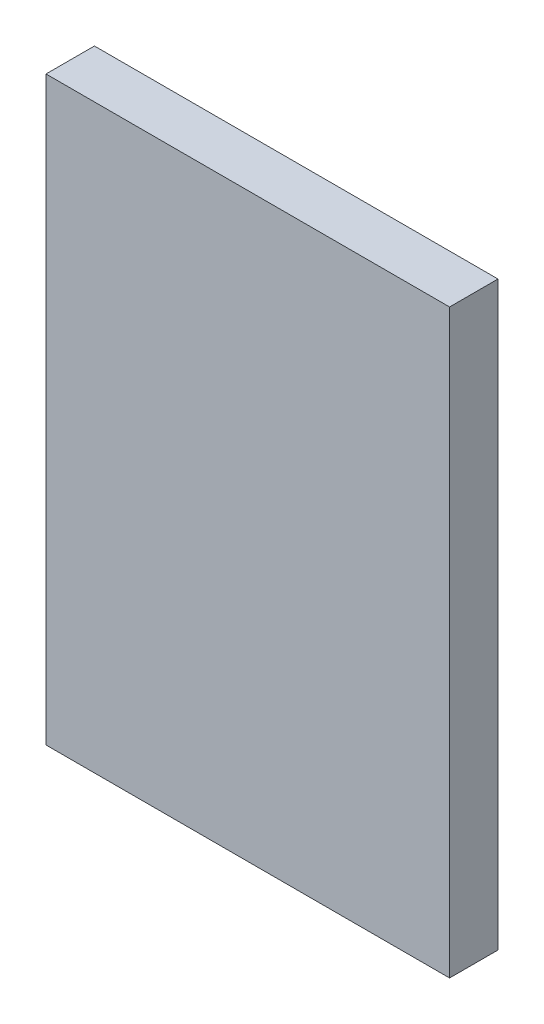
ISO-10303-21;
HEADER;
FILE_DESCRIPTION(('STEP AP214'),'2;1');
FILE_NAME('part.step','',(''),(''),'','','');
FILE_SCHEMA(('AUTOMOTIVE_DESIGN { 1 0 10303 214 1 1 1 1 }'));
ENDSEC;
DATA;
#1=APPLICATION_CONTEXT('core data for automotive mechanical design processes');
#2=APPLICATION_PROTOCOL_DEFINITION('international standard','automotive_design',2000,#1);
#3=PRODUCT_CONTEXT('',#1,'mechanical');
#4=PRODUCT('Part','Part','',(#3));
#5=PRODUCT_RELATED_PRODUCT_CATEGORY('part','',(#4));
#6=PRODUCT_DEFINITION_FORMATION('','',#4);
#7=PRODUCT_DEFINITION_CONTEXT('part definition',#1,'design');
#8=PRODUCT_DEFINITION('design','',#6,#7);
#9=PRODUCT_DEFINITION_SHAPE('','',#8);
#10=(LENGTH_UNIT() NAMED_UNIT(*) SI_UNIT(.MILLI.,.METRE.));
#11=(NAMED_UNIT(*) PLANE_ANGLE_UNIT() SI_UNIT($,.RADIAN.));
#12=(NAMED_UNIT(*) SI_UNIT($,.STERADIAN.) SOLID_ANGLE_UNIT());
#13=UNCERTAINTY_MEASURE_WITH_UNIT(LENGTH_MEASURE(1.E-05),#10,'distance_accuracy_value','');
#14=(GEOMETRIC_REPRESENTATION_CONTEXT(3) GLOBAL_UNCERTAINTY_ASSIGNED_CONTEXT((#13)) GLOBAL_UNIT_ASSIGNED_CONTEXT((#10,
#11,#12)) REPRESENTATION_CONTEXT('',''));
#15=CARTESIAN_POINT('',(0.,0.,0.));
#16=DIRECTION('',(0.,0.,1.));
#17=DIRECTION('',(1.,0.,0.));
#18=AXIS2_PLACEMENT_3D('',#15,#16,#17);
#19=CARTESIAN_POINT('',(-6.35162601626016,7.52032520325202,3.));
#20=DIRECTION('',(1.,0.,0.));
#21=DIRECTION('',(0.,1.,0.));
#22=AXIS2_PLACEMENT_3D('',#19,#20,#21);
#23=PLANE('',#22);
#24=DIRECTION('',(0.,-1.,0.));
#25=VECTOR('',#24,1.);
#26=CARTESIAN_POINT('',(-6.35162601626016,7.52032520325202,0.));
#27=LINE('',#26,#25);
#28=CARTESIAN_POINT('',(-6.35162601626016,7.52032520325202,0.));
#29=VERTEX_POINT('',#28);
#30=CARTESIAN_POINT('',(-6.35162601626016,-28.479674796748,0.));
#31=VERTEX_POINT('',#30);
#32=EDGE_CURVE('E107',#29,#31,#27,.T.);
#33=ORIENTED_EDGE('',*,*,#32,.T.);
#34=DIRECTION('',(0.,0.,-1.));
#35=VECTOR('',#34,1.);
#36=CARTESIAN_POINT('',(-6.35162601626016,-28.479674796748,3.));
#37=LINE('',#36,#35);
#38=CARTESIAN_POINT('',(-6.35162601626016,-28.479674796748,3.));
#39=VERTEX_POINT('',#38);
#40=EDGE_CURVE('E11',#39,#31,#37,.T.);
#41=ORIENTED_EDGE('',*,*,#40,.F.);
#42=DIRECTION('',(0.,-1.,0.));
#43=VECTOR('',#42,1.);
#44=CARTESIAN_POINT('',(-6.35162601626016,7.52032520325202,3.));
#45=LINE('',#44,#43);
#46=CARTESIAN_POINT('',(-6.35162601626016,7.52032520325202,3.));
#47=VERTEX_POINT('',#46);
#48=EDGE_CURVE('E91',#47,#39,#45,.T.);
#49=ORIENTED_EDGE('',*,*,#48,.F.);
#50=DIRECTION('',(0.,0.,-1.));
#51=VECTOR('',#50,1.);
#52=CARTESIAN_POINT('',(-6.35162601626016,7.52032520325202,3.));
#53=LINE('',#52,#51);
#54=EDGE_CURVE('E103',#47,#29,#53,.T.);
#55=ORIENTED_EDGE('',*,*,#54,.T.);
#56=EDGE_LOOP('',(#33,#41,#49,#55));
#57=FACE_BOUND('',#56,.T.);
#58=ADVANCED_FACE('F39',(#57),#23,.F.);
#59=CARTESIAN_POINT('',(-6.35162601626016,-28.479674796748,3.));
#60=DIRECTION('',(0.,1.,0.));
#61=DIRECTION('',(0.,0.,1.));
#62=AXIS2_PLACEMENT_3D('',#59,#60,#61);
#63=PLANE('',#62);
#64=DIRECTION('',(1.,0.,0.));
#65=VECTOR('',#64,1.);
#66=CARTESIAN_POINT('',(-6.35162601626016,-28.479674796748,0.));
#67=LINE('',#66,#65);
#68=CARTESIAN_POINT('',(18.6483739837398,-28.479674796748,0.));
#69=VERTEX_POINT('',#68);
#70=EDGE_CURVE('E96',#31,#69,#67,.T.);
#71=ORIENTED_EDGE('',*,*,#70,.T.);
#72=DIRECTION('',(0.,0.,-1.));
#73=VECTOR('',#72,1.);
#74=CARTESIAN_POINT('',(18.6483739837398,-28.479674796748,3.));
#75=LINE('',#74,#73);
#76=CARTESIAN_POINT('',(18.6483739837398,-28.479674796748,3.));
#77=VERTEX_POINT('',#76);
#78=EDGE_CURVE('E48',#77,#69,#75,.T.);
#79=ORIENTED_EDGE('',*,*,#78,.F.);
#80=DIRECTION('',(1.,0.,0.));
#81=VECTOR('',#80,1.);
#82=CARTESIAN_POINT('',(-6.35162601626016,-28.479674796748,3.));
#83=LINE('',#82,#81);
#84=EDGE_CURVE('E86',#39,#77,#83,.T.);
#85=ORIENTED_EDGE('',*,*,#84,.F.);
#86=ORIENTED_EDGE('',*,*,#40,.T.);
#87=EDGE_LOOP('',(#71,#79,#85,#86));
#88=FACE_BOUND('',#87,.T.);
#89=ADVANCED_FACE('F95',(#88),#63,.F.);
#90=CARTESIAN_POINT('',(18.6483739837398,7.52032520325202,3.));
#91=DIRECTION('',(-1.,0.,0.));
#92=DIRECTION('',(0.,-1.,0.));
#93=AXIS2_PLACEMENT_3D('',#90,#91,#92);
#94=PLANE('',#93);
#95=DIRECTION('',(0.,1.,0.));
#96=VECTOR('',#95,1.);
#97=CARTESIAN_POINT('',(18.6483739837398,7.52032520325202,0.));
#98=LINE('',#97,#96);
#99=CARTESIAN_POINT('',(18.6483739837398,7.52032520325202,0.));
#100=VERTEX_POINT('',#99);
#101=EDGE_CURVE('E73',#69,#100,#98,.T.);
#102=ORIENTED_EDGE('',*,*,#101,.T.);
#103=DIRECTION('',(0.,0.,-1.));
#104=VECTOR('',#103,1.);
#105=CARTESIAN_POINT('',(18.6483739837398,7.52032520325202,3.));
#106=LINE('',#105,#104);
#107=CARTESIAN_POINT('',(18.6483739837398,7.52032520325202,3.));
#108=VERTEX_POINT('',#107);
#109=EDGE_CURVE('E98',#108,#100,#106,.T.);
#110=ORIENTED_EDGE('',*,*,#109,.F.);
#111=DIRECTION('',(0.,1.,0.));
#112=VECTOR('',#111,1.);
#113=CARTESIAN_POINT('',(18.6483739837398,7.52032520325202,3.));
#114=LINE('',#113,#112);
#115=EDGE_CURVE('E89',#77,#108,#114,.T.);
#116=ORIENTED_EDGE('',*,*,#115,.F.);
#117=ORIENTED_EDGE('',*,*,#78,.T.);
#118=EDGE_LOOP('',(#102,#110,#116,#117));
#119=FACE_BOUND('',#118,.T.);
#120=ADVANCED_FACE('F99',(#119),#94,.F.);
#121=CARTESIAN_POINT('',(-6.35162601626016,7.52032520325202,3.));
#122=DIRECTION('',(0.,-1.,0.));
#123=DIRECTION('',(0.,0.,-1.));
#124=AXIS2_PLACEMENT_3D('',#121,#122,#123);
#125=PLANE('',#124);
#126=DIRECTION('',(-1.,0.,0.));
#127=VECTOR('',#126,1.);
#128=CARTESIAN_POINT('',(-6.35162601626016,7.52032520325202,0.));
#129=LINE('',#128,#127);
#130=EDGE_CURVE('E79',#100,#29,#129,.T.);
#131=ORIENTED_EDGE('',*,*,#130,.T.);
#132=ORIENTED_EDGE('',*,*,#54,.F.);
#133=DIRECTION('',(-1.,0.,0.));
#134=VECTOR('',#133,1.);
#135=CARTESIAN_POINT('',(-6.35162601626016,7.52032520325202,3.));
#136=LINE('',#135,#134);
#137=EDGE_CURVE('E56',#108,#47,#136,.T.);
#138=ORIENTED_EDGE('',*,*,#137,.F.);
#139=ORIENTED_EDGE('',*,*,#109,.T.);
#140=EDGE_LOOP('',(#131,#132,#138,#139));
#141=FACE_BOUND('',#140,.T.);
#142=ADVANCED_FACE('F121',(#141),#125,.F.);
#143=CARTESIAN_POINT('',(0.,0.,3.));
#144=DIRECTION('',(0.,0.,1.));
#145=DIRECTION('',(1.,0.,0.));
#146=AXIS2_PLACEMENT_3D('',#143,#144,#145);
#147=PLANE('',#146);
#148=ORIENTED_EDGE('',*,*,#48,.T.);
#149=ORIENTED_EDGE('',*,*,#84,.T.);
#150=ORIENTED_EDGE('',*,*,#115,.T.);
#151=ORIENTED_EDGE('',*,*,#137,.T.);
#152=EDGE_LOOP('',(#148,#149,#150,#151));
#153=FACE_BOUND('',#152,.T.);
#154=ADVANCED_FACE('F87',(#153),#147,.T.);
#155=CARTESIAN_POINT('',(0.,0.,0.));
#156=DIRECTION('',(0.,0.,1.));
#157=DIRECTION('',(1.,0.,0.));
#158=AXIS2_PLACEMENT_3D('',#155,#156,#157);
#159=PLANE('',#158);
#160=ORIENTED_EDGE('',*,*,#32,.F.);
#161=ORIENTED_EDGE('',*,*,#130,.F.);
#162=ORIENTED_EDGE('',*,*,#101,.F.);
#163=ORIENTED_EDGE('',*,*,#70,.F.);
#164=EDGE_LOOP('',(#160,#161,#162,#163));
#165=FACE_BOUND('',#164,.T.);
#166=ADVANCED_FACE('F124',(#165),#159,.F.);
#167=CLOSED_SHELL('',(#58,#89,#120,#142,#154,#166));
#168=MANIFOLD_SOLID_BREP('B2',#167);
#169=ADVANCED_BREP_SHAPE_REPRESENTATION('',(#18,#168),#14);
#170=SHAPE_DEFINITION_REPRESENTATION(#9,#169);
ENDSEC;
END-ISO-10303-21;
